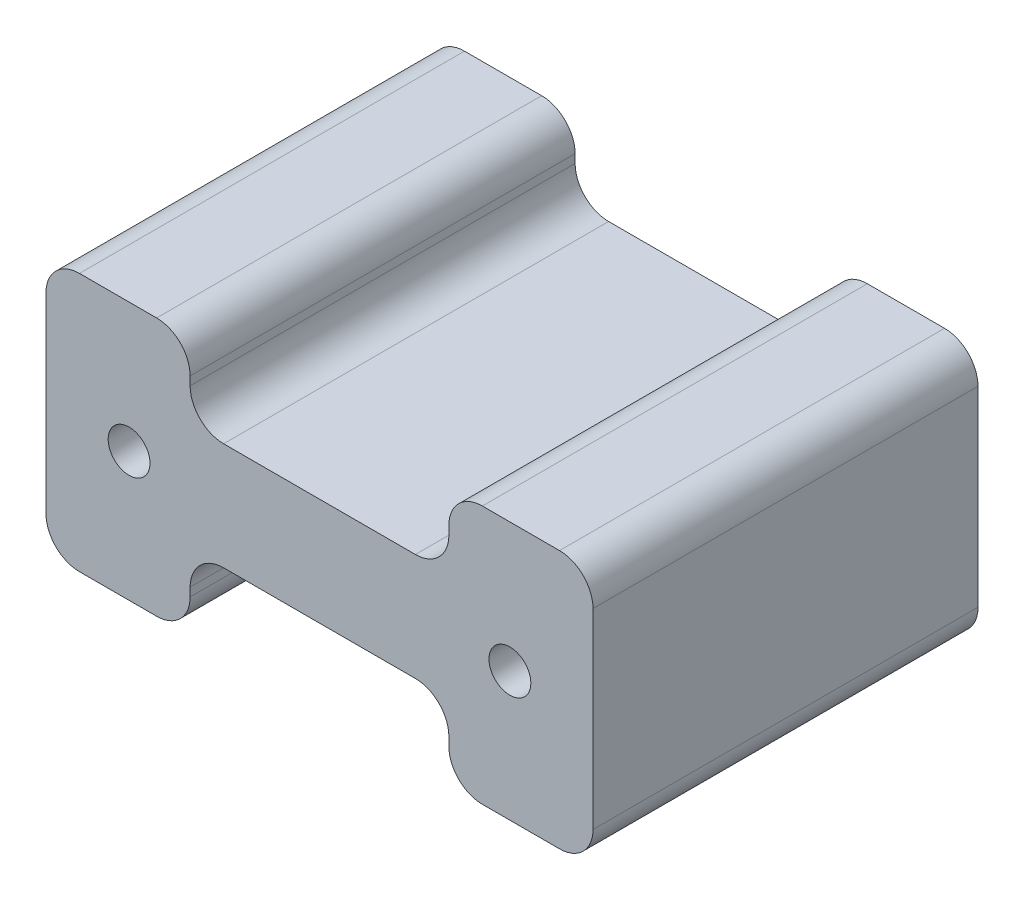
ISO-10303-21;
HEADER;
FILE_DESCRIPTION(('STEP AP214'),'2;1');
FILE_NAME('part.step','',(''),(''),'','','');
FILE_SCHEMA(('AUTOMOTIVE_DESIGN { 1 0 10303 214 1 1 1 1 }'));
ENDSEC;
DATA;
#1=APPLICATION_CONTEXT('core data for automotive mechanical design processes');
#2=APPLICATION_PROTOCOL_DEFINITION('international standard','automotive_design',2000,#1);
#3=PRODUCT_CONTEXT('',#1,'mechanical');
#4=PRODUCT('Part','Part','',(#3));
#5=PRODUCT_RELATED_PRODUCT_CATEGORY('part','',(#4));
#6=PRODUCT_DEFINITION_FORMATION('','',#4);
#7=PRODUCT_DEFINITION_CONTEXT('part definition',#1,'design');
#8=PRODUCT_DEFINITION('design','',#6,#7);
#9=PRODUCT_DEFINITION_SHAPE('','',#8);
#10=(LENGTH_UNIT() NAMED_UNIT(*) SI_UNIT(.MILLI.,.METRE.));
#11=(NAMED_UNIT(*) PLANE_ANGLE_UNIT() SI_UNIT($,.RADIAN.));
#12=(NAMED_UNIT(*) SI_UNIT($,.STERADIAN.) SOLID_ANGLE_UNIT());
#13=UNCERTAINTY_MEASURE_WITH_UNIT(LENGTH_MEASURE(1.E-05),#10,'distance_accuracy_value','');
#14=(GEOMETRIC_REPRESENTATION_CONTEXT(3) GLOBAL_UNCERTAINTY_ASSIGNED_CONTEXT((#13)) GLOBAL_UNIT_ASSIGNED_CONTEXT((#10,
#11,#12)) REPRESENTATION_CONTEXT('',''));
#15=CARTESIAN_POINT('',(0.,0.,0.));
#16=DIRECTION('',(0.,0.,1.));
#17=DIRECTION('',(1.,0.,0.));
#18=AXIS2_PLACEMENT_3D('',#15,#16,#17);
#19=CARTESIAN_POINT('',(-20.0653915042754,18.6420857532212,-23.));
#20=DIRECTION('',(0.,-1.,0.));
#21=DIRECTION('',(0.,0.,-1.));
#22=AXIS2_PLACEMENT_3D('',#19,#20,#21);
#23=PLANE('',#22);
#24=DIRECTION('',(1.,0.,0.));
#25=VECTOR('',#24,1.);
#26=CARTESIAN_POINT('',(-20.0653915042754,18.6420857532212,0.));
#27=LINE('',#26,#25);
#28=CARTESIAN_POINT('',(6.00236147383035,18.6420857532212,0.));
#29=VERTEX_POINT('',#28);
#30=CARTESIAN_POINT('',(10.6119967977161,18.6420857532212,0.));
#31=VERTEX_POINT('',#30);
#32=EDGE_CURVE('E388',#29,#31,#27,.T.);
#33=ORIENTED_EDGE('',*,*,#32,.F.);
#34=DIRECTION('',(0.,0.,1.));
#35=VECTOR('',#34,1.);
#36=CARTESIAN_POINT('',(6.00236147383035,18.6420857532212,-23.));
#37=LINE('',#36,#35);
#38=CARTESIAN_POINT('',(6.00236147383035,18.6420857532212,-23.));
#39=VERTEX_POINT('',#38);
#40=EDGE_CURVE('E200',#29,#39,#37,.F.);
#41=ORIENTED_EDGE('',*,*,#40,.T.);
#42=DIRECTION('',(1.,0.,0.));
#43=VECTOR('',#42,1.);
#44=CARTESIAN_POINT('',(-20.0653915042754,18.6420857532212,-23.));
#45=LINE('',#44,#43);
#46=CARTESIAN_POINT('',(10.6119967977161,18.6420857532212,-23.));
#47=VERTEX_POINT('',#46);
#48=EDGE_CURVE('E194',#39,#47,#45,.T.);
#49=ORIENTED_EDGE('',*,*,#48,.T.);
#50=DIRECTION('',(0.,0.,1.));
#51=VECTOR('',#50,1.);
#52=CARTESIAN_POINT('',(10.6119967977161,18.6420857532212,-23.));
#53=LINE('',#52,#51);
#54=EDGE_CURVE('E198',#47,#31,#53,.T.);
#55=ORIENTED_EDGE('',*,*,#54,.T.);
#56=EDGE_LOOP('',(#33,#41,#49,#55));
#57=FACE_BOUND('',#56,.T.);
#58=ADVANCED_FACE('F33',(#57),#23,.T.);
#59=CARTESIAN_POINT('',(-20.0653915042754,34.0750636250568,-23.));
#60=DIRECTION('',(0.,1.,0.));
#61=DIRECTION('',(0.,0.,1.));
#62=AXIS2_PLACEMENT_3D('',#59,#60,#61);
#63=PLANE('',#62);
#64=DIRECTION('',(-1.,0.,0.));
#65=VECTOR('',#64,1.);
#66=CARTESIAN_POINT('',(-20.0653915042754,34.0750636250568,0.));
#67=LINE('',#66,#65);
#68=CARTESIAN_POINT('',(-13.4557561803896,34.0750636250568,0.));
#69=VERTEX_POINT('',#68);
#70=CARTESIAN_POINT('',(-18.0653915042754,34.0750636250568,0.));
#71=VERTEX_POINT('',#70);
#72=EDGE_CURVE('E380',#69,#71,#67,.T.);
#73=ORIENTED_EDGE('',*,*,#72,.F.);
#74=DIRECTION('',(0.,0.,1.));
#75=VECTOR('',#74,1.);
#76=CARTESIAN_POINT('',(-13.4557561803896,34.0750636250568,-23.));
#77=LINE('',#76,#75);
#78=CARTESIAN_POINT('',(-13.4557561803896,34.0750636250568,-23.));
#79=VERTEX_POINT('',#78);
#80=EDGE_CURVE('E269',#69,#79,#77,.F.);
#81=ORIENTED_EDGE('',*,*,#80,.T.);
#82=DIRECTION('',(-1.,0.,0.));
#83=VECTOR('',#82,1.);
#84=CARTESIAN_POINT('',(-20.0653915042754,34.0750636250568,-23.));
#85=LINE('',#84,#83);
#86=CARTESIAN_POINT('',(-18.0653915042754,34.0750636250568,-23.));
#87=VERTEX_POINT('',#86);
#88=EDGE_CURVE('E370',#79,#87,#85,.T.);
#89=ORIENTED_EDGE('',*,*,#88,.T.);
#90=DIRECTION('',(0.,0.,1.));
#91=VECTOR('',#90,1.);
#92=CARTESIAN_POINT('',(-18.0653915042754,34.0750636250568,-23.));
#93=LINE('',#92,#91);
#94=EDGE_CURVE('E253',#87,#71,#93,.T.);
#95=ORIENTED_EDGE('',*,*,#94,.T.);
#96=EDGE_LOOP('',(#73,#81,#89,#95));
#97=FACE_BOUND('',#96,.T.);
#98=ADVANCED_FACE('F444',(#97),#63,.T.);
#99=CARTESIAN_POINT('',(12.6119967977161,34.0750636250568,-23.));
#100=DIRECTION('',(1.,0.,0.));
#101=DIRECTION('',(0.,0.,-1.));
#102=AXIS2_PLACEMENT_3D('',#99,#100,#101);
#103=PLANE('',#102);
#104=DIRECTION('',(0.,1.,0.));
#105=VECTOR('',#104,1.);
#106=CARTESIAN_POINT('',(12.6119967977161,34.0750636250568,0.));
#107=LINE('',#106,#105);
#108=CARTESIAN_POINT('',(12.6119967977161,20.6420857532212,0.));
#109=VERTEX_POINT('',#108);
#110=CARTESIAN_POINT('',(12.6119967977161,32.0750636250568,0.));
#111=VERTEX_POINT('',#110);
#112=EDGE_CURVE('E377',#109,#111,#107,.T.);
#113=ORIENTED_EDGE('',*,*,#112,.F.);
#114=DIRECTION('',(0.,0.,1.));
#115=VECTOR('',#114,1.);
#116=CARTESIAN_POINT('',(12.6119967977161,20.6420857532212,-23.));
#117=LINE('',#116,#115);
#118=CARTESIAN_POINT('',(12.6119967977161,20.6420857532212,-23.));
#119=VERTEX_POINT('',#118);
#120=EDGE_CURVE('E237',#109,#119,#117,.F.);
#121=ORIENTED_EDGE('',*,*,#120,.T.);
#122=DIRECTION('',(0.,1.,0.));
#123=VECTOR('',#122,1.);
#124=CARTESIAN_POINT('',(12.6119967977161,34.0750636250568,-23.));
#125=LINE('',#124,#123);
#126=CARTESIAN_POINT('',(12.6119967977161,32.0750636250568,-23.));
#127=VERTEX_POINT('',#126);
#128=EDGE_CURVE('E211',#119,#127,#125,.T.);
#129=ORIENTED_EDGE('',*,*,#128,.T.);
#130=DIRECTION('',(0.,0.,1.));
#131=VECTOR('',#130,1.);
#132=CARTESIAN_POINT('',(12.6119967977161,32.0750636250568,-23.));
#133=LINE('',#132,#131);
#134=EDGE_CURVE('E234',#127,#111,#133,.T.);
#135=ORIENTED_EDGE('',*,*,#134,.T.);
#136=EDGE_LOOP('',(#113,#121,#129,#135));
#137=FACE_BOUND('',#136,.T.);
#138=ADVANCED_FACE('F446',(#137),#103,.T.);
#139=CARTESIAN_POINT('',(-18.0653915042754,18.6420857532212,-23.));
#140=VERTEX_POINT('',#139);
#141=CARTESIAN_POINT('',(-13.4557561803896,18.6420857532212,-23.));
#142=VERTEX_POINT('',#141);
#143=EDGE_CURVE('E202',#140,#142,#45,.T.);
#144=ORIENTED_EDGE('',*,*,#143,.T.);
#145=DIRECTION('',(0.,0.,-1.));
#146=VECTOR('',#145,1.);
#147=CARTESIAN_POINT('',(-13.4557561803896,18.6420857532212,0.));
#148=LINE('',#147,#146);
#149=CARTESIAN_POINT('',(-13.4557561803896,18.6420857532212,0.));
#150=VERTEX_POINT('',#149);
#151=EDGE_CURVE('E297',#142,#150,#148,.F.);
#152=ORIENTED_EDGE('',*,*,#151,.T.);
#153=CARTESIAN_POINT('',(-18.0653915042754,18.6420857532212,0.));
#154=VERTEX_POINT('',#153);
#155=EDGE_CURVE('E371',#154,#150,#27,.T.);
#156=ORIENTED_EDGE('',*,*,#155,.F.);
#157=DIRECTION('',(0.,0.,1.));
#158=VECTOR('',#157,1.);
#159=CARTESIAN_POINT('',(-18.0653915042754,18.6420857532212,-23.));
#160=LINE('',#159,#158);
#161=EDGE_CURVE('E251',#154,#140,#160,.F.);
#162=ORIENTED_EDGE('',*,*,#161,.T.);
#163=EDGE_LOOP('',(#144,#152,#156,#162));
#164=FACE_BOUND('',#163,.T.);
#165=ADVANCED_FACE('F422',(#164),#23,.T.);
#166=CARTESIAN_POINT('',(-20.0653915042754,34.0750636250568,-23.));
#167=DIRECTION('',(-1.,0.,0.));
#168=DIRECTION('',(0.,0.,1.));
#169=AXIS2_PLACEMENT_3D('',#166,#167,#168);
#170=PLANE('',#169);
#171=DIRECTION('',(0.,-1.,0.));
#172=VECTOR('',#171,1.);
#173=CARTESIAN_POINT('',(-20.0653915042754,34.0750636250568,-23.));
#174=LINE('',#173,#172);
#175=CARTESIAN_POINT('',(-20.0653915042754,32.0750636250568,-23.));
#176=VERTEX_POINT('',#175);
#177=CARTESIAN_POINT('',(-20.0653915042754,20.6420857532212,-23.));
#178=VERTEX_POINT('',#177);
#179=EDGE_CURVE('E203',#176,#178,#174,.T.);
#180=ORIENTED_EDGE('',*,*,#179,.T.);
#181=DIRECTION('',(0.,0.,1.));
#182=VECTOR('',#181,1.);
#183=CARTESIAN_POINT('',(-20.0653915042754,20.6420857532212,-23.));
#184=LINE('',#183,#182);
#185=CARTESIAN_POINT('',(-20.0653915042754,20.6420857532212,0.));
#186=VERTEX_POINT('',#185);
#187=EDGE_CURVE('E248',#178,#186,#184,.T.);
#188=ORIENTED_EDGE('',*,*,#187,.T.);
#189=DIRECTION('',(0.,-1.,0.));
#190=VECTOR('',#189,1.);
#191=CARTESIAN_POINT('',(-20.0653915042754,34.0750636250568,0.));
#192=LINE('',#191,#190);
#193=CARTESIAN_POINT('',(-20.0653915042754,32.0750636250568,0.));
#194=VERTEX_POINT('',#193);
#195=EDGE_CURVE('E385',#194,#186,#192,.T.);
#196=ORIENTED_EDGE('',*,*,#195,.F.);
#197=DIRECTION('',(0.,0.,1.));
#198=VECTOR('',#197,1.);
#199=CARTESIAN_POINT('',(-20.0653915042754,32.0750636250568,-23.));
#200=LINE('',#199,#198);
#201=EDGE_CURVE('E246',#194,#176,#200,.F.);
#202=ORIENTED_EDGE('',*,*,#201,.T.);
#203=EDGE_LOOP('',(#180,#188,#196,#202));
#204=FACE_BOUND('',#203,.T.);
#205=ADVANCED_FACE('F431',(#204),#170,.T.);
#206=CARTESIAN_POINT('',(10.6119967977161,34.0750636250568,-23.));
#207=VERTEX_POINT('',#206);
#208=CARTESIAN_POINT('',(6.00236147383036,34.0750636250568,-23.));
#209=VERTEX_POINT('',#208);
#210=EDGE_CURVE('E372',#207,#209,#85,.T.);
#211=ORIENTED_EDGE('',*,*,#210,.T.);
#212=DIRECTION('',(0.,0.,-1.));
#213=VECTOR('',#212,1.);
#214=CARTESIAN_POINT('',(6.00236147383035,34.0750636250568,0.));
#215=LINE('',#214,#213);
#216=CARTESIAN_POINT('',(6.00236147383036,34.0750636250568,0.));
#217=VERTEX_POINT('',#216);
#218=EDGE_CURVE('E283',#209,#217,#215,.F.);
#219=ORIENTED_EDGE('',*,*,#218,.T.);
#220=CARTESIAN_POINT('',(10.6119967977161,34.0750636250568,0.));
#221=VERTEX_POINT('',#220);
#222=EDGE_CURVE('E382',#221,#217,#67,.T.);
#223=ORIENTED_EDGE('',*,*,#222,.F.);
#224=DIRECTION('',(0.,0.,1.));
#225=VECTOR('',#224,1.);
#226=CARTESIAN_POINT('',(10.6119967977161,34.0750636250568,-23.));
#227=LINE('',#226,#225);
#228=EDGE_CURVE('E214',#221,#207,#227,.F.);
#229=ORIENTED_EDGE('',*,*,#228,.T.);
#230=EDGE_LOOP('',(#211,#219,#223,#229));
#231=FACE_BOUND('',#230,.T.);
#232=ADVANCED_FACE('F448',(#231),#63,.T.);
#233=CARTESIAN_POINT('',(0.,0.,-23.));
#234=DIRECTION('',(0.,0.,1.));
#235=DIRECTION('',(1.,0.,0.));
#236=AXIS2_PLACEMENT_3D('',#233,#234,#235);
#237=PLANE('',#236);
#238=CARTESIAN_POINT('',(-15.1016973532796,26.358574689139,-23.));
#239=DIRECTION('',(0.,0.,1.));
#240=DIRECTION('',(1.,0.,0.));
#241=AXIS2_PLACEMENT_3D('',#238,#239,#240);
#242=CIRCLE('',#241,1.25);
#243=CARTESIAN_POINT('',(-13.8516973532796,26.358574689139,-23.));
#244=VERTEX_POINT('',#243);
#245=EDGE_CURVE('E381',#244,#244,#242,.T.);
#246=ORIENTED_EDGE('',*,*,#245,.T.);
#247=EDGE_LOOP('',(#246));
#248=FACE_BOUND('',#247,.T.);
#249=CARTESIAN_POINT('',(7.64830264672036,26.358574689139,-23.));
#250=DIRECTION('',(0.,0.,1.));
#251=DIRECTION('',(1.,0.,0.));
#252=AXIS2_PLACEMENT_3D('',#249,#250,#251);
#253=CIRCLE('',#252,1.25);
#254=CARTESIAN_POINT('',(8.89830264672036,26.358574689139,-23.));
#255=VERTEX_POINT('',#254);
#256=EDGE_CURVE('E700',#255,#255,#253,.T.);
#257=ORIENTED_EDGE('',*,*,#256,.T.);
#258=EDGE_LOOP('',(#257));
#259=FACE_BOUND('',#258,.T.);
#260=ORIENTED_EDGE('',*,*,#88,.F.);
#261=CARTESIAN_POINT('',(-13.4557561803896,32.0750636250568,-23.));
#262=DIRECTION('',(0.,0.,1.));
#263=DIRECTION('',(1.,0.,0.));
#264=AXIS2_PLACEMENT_3D('',#261,#262,#263);
#265=CIRCLE('',#264,2.);
#266=CARTESIAN_POINT('',(-11.4557561803896,32.0750636250568,-23.));
#267=VERTEX_POINT('',#266);
#268=EDGE_CURVE('E276',#79,#267,#265,.F.);
#269=ORIENTED_EDGE('',*,*,#268,.T.);
#270=DIRECTION('',(0.,-1.,0.));
#271=VECTOR('',#270,1.);
#272=CARTESIAN_POINT('',(-11.4557561803896,29.5665320005796,-23.));
#273=LINE('',#272,#271);
#274=CARTESIAN_POINT('',(-11.4557561803896,31.5665320005796,-23.));
#275=VERTEX_POINT('',#274);
#276=EDGE_CURVE('E339',#267,#275,#273,.T.);
#277=ORIENTED_EDGE('',*,*,#276,.T.);
#278=CARTESIAN_POINT('',(-9.45575618038963,31.5665320005796,-23.));
#279=DIRECTION('',(0.,0.,1.));
#280=DIRECTION('',(1.,0.,0.));
#281=AXIS2_PLACEMENT_3D('',#278,#279,#280);
#282=CIRCLE('',#281,2.);
#283=CARTESIAN_POINT('',(-9.45575618038963,29.5665320005796,-23.));
#284=VERTEX_POINT('',#283);
#285=EDGE_CURVE('E11',#275,#284,#282,.T.);
#286=ORIENTED_EDGE('',*,*,#285,.T.);
#287=DIRECTION('',(1.,0.,0.));
#288=VECTOR('',#287,1.);
#289=CARTESIAN_POINT('',(4.00236147383035,29.5665320005796,-23.));
#290=LINE('',#289,#288);
#291=CARTESIAN_POINT('',(2.00236147383035,29.5665320005796,-23.));
#292=VERTEX_POINT('',#291);
#293=EDGE_CURVE('E337',#284,#292,#290,.T.);
#294=ORIENTED_EDGE('',*,*,#293,.T.);
#295=CARTESIAN_POINT('',(2.00236147383035,31.5665320005796,-23.));
#296=DIRECTION('',(0.,0.,1.));
#297=DIRECTION('',(1.,0.,0.));
#298=AXIS2_PLACEMENT_3D('',#295,#296,#297);
#299=CIRCLE('',#298,2.);
#300=CARTESIAN_POINT('',(4.00236147383035,31.5665320005796,-23.));
#301=VERTEX_POINT('',#300);
#302=EDGE_CURVE('E319',#292,#301,#299,.T.);
#303=ORIENTED_EDGE('',*,*,#302,.T.);
#304=DIRECTION('',(0.,1.,0.));
#305=VECTOR('',#304,1.);
#306=CARTESIAN_POINT('',(4.00236147383035,29.5665320005796,-23.));
#307=LINE('',#306,#305);
#308=CARTESIAN_POINT('',(4.00236147383035,32.0750636250568,-23.));
#309=VERTEX_POINT('',#308);
#310=EDGE_CURVE('E343',#301,#309,#307,.T.);
#311=ORIENTED_EDGE('',*,*,#310,.T.);
#312=CARTESIAN_POINT('',(6.00236147383035,32.0750636250568,-23.));
#313=DIRECTION('',(0.,0.,1.));
#314=DIRECTION('',(1.,0.,0.));
#315=AXIS2_PLACEMENT_3D('',#312,#313,#314);
#316=CIRCLE('',#315,2.);
#317=EDGE_CURVE('E48',#309,#209,#316,.F.);
#318=ORIENTED_EDGE('',*,*,#317,.T.);
#319=ORIENTED_EDGE('',*,*,#210,.F.);
#320=CARTESIAN_POINT('',(10.6119967977161,32.0750636250568,-23.));
#321=DIRECTION('',(0.,0.,1.));
#322=DIRECTION('',(1.,0.,0.));
#323=AXIS2_PLACEMENT_3D('',#320,#321,#322);
#324=CIRCLE('',#323,2.);
#325=EDGE_CURVE('E215',#207,#127,#324,.F.);
#326=ORIENTED_EDGE('',*,*,#325,.T.);
#327=ORIENTED_EDGE('',*,*,#128,.F.);
#328=CARTESIAN_POINT('',(10.6119967977161,20.6420857532212,-23.));
#329=DIRECTION('',(0.,0.,1.));
#330=DIRECTION('',(1.,0.,0.));
#331=AXIS2_PLACEMENT_3D('',#328,#329,#330);
#332=CIRCLE('',#331,2.);
#333=EDGE_CURVE('E207',#119,#47,#332,.F.);
#334=ORIENTED_EDGE('',*,*,#333,.T.);
#335=ORIENTED_EDGE('',*,*,#48,.F.);
#336=CARTESIAN_POINT('',(6.00236147383035,20.6420857532212,-23.));
#337=DIRECTION('',(0.,0.,1.));
#338=DIRECTION('',(1.,0.,0.));
#339=AXIS2_PLACEMENT_3D('',#336,#337,#338);
#340=CIRCLE('',#339,2.);
#341=CARTESIAN_POINT('',(4.00236147383035,20.6420857532212,-23.));
#342=VERTEX_POINT('',#341);
#343=EDGE_CURVE('E273',#39,#342,#340,.F.);
#344=ORIENTED_EDGE('',*,*,#343,.T.);
#345=DIRECTION('',(0.,1.,0.));
#346=VECTOR('',#345,1.);
#347=CARTESIAN_POINT('',(4.00236147383035,23.1506173776985,-23.));
#348=LINE('',#347,#346);
#349=CARTESIAN_POINT('',(4.00236147383035,21.1506173776985,-23.));
#350=VERTEX_POINT('',#349);
#351=EDGE_CURVE('E355',#342,#350,#348,.T.);
#352=ORIENTED_EDGE('',*,*,#351,.T.);
#353=CARTESIAN_POINT('',(2.00236147383035,21.1506173776985,-23.));
#354=DIRECTION('',(0.,0.,1.));
#355=DIRECTION('',(1.,0.,0.));
#356=AXIS2_PLACEMENT_3D('',#353,#354,#355);
#357=CIRCLE('',#356,2.);
#358=CARTESIAN_POINT('',(2.00236147383035,23.1506173776985,-23.));
#359=VERTEX_POINT('',#358);
#360=EDGE_CURVE('E315',#350,#359,#357,.T.);
#361=ORIENTED_EDGE('',*,*,#360,.T.);
#362=DIRECTION('',(-1.,0.,0.));
#363=VECTOR('',#362,1.);
#364=CARTESIAN_POINT('',(4.00236147383035,23.1506173776985,-23.));
#365=LINE('',#364,#363);
#366=CARTESIAN_POINT('',(-9.45575618038963,23.1506173776985,-23.));
#367=VERTEX_POINT('',#366);
#368=EDGE_CURVE('E358',#359,#367,#365,.T.);
#369=ORIENTED_EDGE('',*,*,#368,.T.);
#370=CARTESIAN_POINT('',(-9.45575618038964,21.1506173776985,-23.));
#371=DIRECTION('',(0.,0.,1.));
#372=DIRECTION('',(1.,0.,0.));
#373=AXIS2_PLACEMENT_3D('',#370,#371,#372);
#374=CIRCLE('',#373,2.);
#375=CARTESIAN_POINT('',(-11.4557561803896,21.1506173776985,-23.));
#376=VERTEX_POINT('',#375);
#377=EDGE_CURVE('E311',#367,#376,#374,.T.);
#378=ORIENTED_EDGE('',*,*,#377,.T.);
#379=DIRECTION('',(0.,-1.,0.));
#380=VECTOR('',#379,1.);
#381=CARTESIAN_POINT('',(-11.4557561803896,23.1506173776985,-23.));
#382=LINE('',#381,#380);
#383=CARTESIAN_POINT('',(-11.4557561803896,20.6420857532212,-23.));
#384=VERTEX_POINT('',#383);
#385=EDGE_CURVE('E352',#376,#384,#382,.T.);
#386=ORIENTED_EDGE('',*,*,#385,.T.);
#387=CARTESIAN_POINT('',(-13.4557561803896,20.6420857532212,-23.));
#388=DIRECTION('',(0.,0.,1.));
#389=DIRECTION('',(1.,0.,0.));
#390=AXIS2_PLACEMENT_3D('',#387,#388,#389);
#391=CIRCLE('',#390,2.);
#392=EDGE_CURVE('E271',#384,#142,#391,.F.);
#393=ORIENTED_EDGE('',*,*,#392,.T.);
#394=ORIENTED_EDGE('',*,*,#143,.F.);
#395=CARTESIAN_POINT('',(-18.0653915042754,20.6420857532212,-23.));
#396=DIRECTION('',(0.,0.,1.));
#397=DIRECTION('',(1.,0.,0.));
#398=AXIS2_PLACEMENT_3D('',#395,#396,#397);
#399=CIRCLE('',#398,2.);
#400=EDGE_CURVE('E242',#140,#178,#399,.F.);
#401=ORIENTED_EDGE('',*,*,#400,.T.);
#402=ORIENTED_EDGE('',*,*,#179,.F.);
#403=CARTESIAN_POINT('',(-18.0653915042754,32.0750636250568,-23.));
#404=DIRECTION('',(0.,0.,1.));
#405=DIRECTION('',(1.,0.,0.));
#406=AXIS2_PLACEMENT_3D('',#403,#404,#405);
#407=CIRCLE('',#406,2.);
#408=EDGE_CURVE('E239',#176,#87,#407,.F.);
#409=ORIENTED_EDGE('',*,*,#408,.T.);
#410=EDGE_LOOP('',(#260,#269,#277,#286,#294,#303,#311,#318,#319,#326,#327,#334,#335,#344,#352,
#361,#369,#378,#386,#393,#394,#401,#402,#409));
#411=FACE_BOUND('',#410,.T.);
#412=ADVANCED_FACE('F209',(#248,#259,#411),#237,.F.);
#413=CARTESIAN_POINT('',(0.,0.,0.));
#414=DIRECTION('',(0.,0.,1.));
#415=DIRECTION('',(1.,0.,0.));
#416=AXIS2_PLACEMENT_3D('',#413,#414,#415);
#417=PLANE('',#416);
#418=CARTESIAN_POINT('',(-15.1016973532796,26.358574689139,0.));
#419=DIRECTION('',(0.,0.,1.));
#420=DIRECTION('',(1.,0.,0.));
#421=AXIS2_PLACEMENT_3D('',#418,#419,#420);
#422=CIRCLE('',#421,1.25);
#423=CARTESIAN_POINT('',(-13.8516973532796,26.358574689139,0.));
#424=VERTEX_POINT('',#423);
#425=EDGE_CURVE('E696',#424,#424,#422,.T.);
#426=ORIENTED_EDGE('',*,*,#425,.F.);
#427=EDGE_LOOP('',(#426));
#428=FACE_BOUND('',#427,.T.);
#429=CARTESIAN_POINT('',(7.64830264672036,26.358574689139,0.));
#430=DIRECTION('',(0.,0.,1.));
#431=DIRECTION('',(1.,0.,0.));
#432=AXIS2_PLACEMENT_3D('',#429,#430,#431);
#433=CIRCLE('',#432,1.25);
#434=CARTESIAN_POINT('',(8.89830264672036,26.358574689139,0.));
#435=VERTEX_POINT('',#434);
#436=EDGE_CURVE('E345',#435,#435,#433,.T.);
#437=ORIENTED_EDGE('',*,*,#436,.F.);
#438=EDGE_LOOP('',(#437));
#439=FACE_BOUND('',#438,.T.);
#440=DIRECTION('',(0.,-1.,0.));
#441=VECTOR('',#440,1.);
#442=CARTESIAN_POINT('',(-11.4557561803896,0.,0.));
#443=LINE('',#442,#441);
#444=CARTESIAN_POINT('',(-11.4557561803896,32.0750636250568,0.));
#445=VERTEX_POINT('',#444);
#446=CARTESIAN_POINT('',(-11.4557561803896,31.5665320005796,0.));
#447=VERTEX_POINT('',#446);
#448=EDGE_CURVE('E221',#445,#447,#443,.T.);
#449=ORIENTED_EDGE('',*,*,#448,.F.);
#450=CARTESIAN_POINT('',(-13.4557561803896,32.0750636250568,0.));
#451=DIRECTION('',(0.,0.,1.));
#452=DIRECTION('',(1.,0.,0.));
#453=AXIS2_PLACEMENT_3D('',#450,#451,#452);
#454=CIRCLE('',#453,2.);
#455=EDGE_CURVE('E267',#445,#69,#454,.T.);
#456=ORIENTED_EDGE('',*,*,#455,.T.);
#457=ORIENTED_EDGE('',*,*,#72,.T.);
#458=CARTESIAN_POINT('',(-18.0653915042754,32.0750636250568,0.));
#459=DIRECTION('',(0.,0.,1.));
#460=DIRECTION('',(1.,0.,0.));
#461=AXIS2_PLACEMENT_3D('',#458,#459,#460);
#462=CIRCLE('',#461,2.);
#463=EDGE_CURVE('E220',#71,#194,#462,.T.);
#464=ORIENTED_EDGE('',*,*,#463,.T.);
#465=ORIENTED_EDGE('',*,*,#195,.T.);
#466=CARTESIAN_POINT('',(-18.0653915042754,20.6420857532212,0.));
#467=DIRECTION('',(0.,0.,1.));
#468=DIRECTION('',(1.,0.,0.));
#469=AXIS2_PLACEMENT_3D('',#466,#467,#468);
#470=CIRCLE('',#469,2.);
#471=EDGE_CURVE('E223',#186,#154,#470,.T.);
#472=ORIENTED_EDGE('',*,*,#471,.T.);
#473=ORIENTED_EDGE('',*,*,#155,.T.);
#474=CARTESIAN_POINT('',(-13.4557561803896,20.6420857532212,0.));
#475=DIRECTION('',(0.,0.,1.));
#476=DIRECTION('',(1.,0.,0.));
#477=AXIS2_PLACEMENT_3D('',#474,#475,#476);
#478=CIRCLE('',#477,2.);
#479=CARTESIAN_POINT('',(-11.4557561803896,20.6420857532212,0.));
#480=VERTEX_POINT('',#479);
#481=EDGE_CURVE('E261',#150,#480,#478,.T.);
#482=ORIENTED_EDGE('',*,*,#481,.T.);
#483=DIRECTION('',(0.,-1.,0.));
#484=VECTOR('',#483,1.);
#485=CARTESIAN_POINT('',(-11.4557561803896,23.1506173776985,0.));
#486=LINE('',#485,#484);
#487=CARTESIAN_POINT('',(-11.4557561803896,21.1506173776985,0.));
#488=VERTEX_POINT('',#487);
#489=EDGE_CURVE('E359',#488,#480,#486,.T.);
#490=ORIENTED_EDGE('',*,*,#489,.F.);
#491=CARTESIAN_POINT('',(-9.45575618038964,21.1506173776985,0.));
#492=DIRECTION('',(0.,0.,1.));
#493=DIRECTION('',(1.,0.,0.));
#494=AXIS2_PLACEMENT_3D('',#491,#492,#493);
#495=CIRCLE('',#494,2.);
#496=CARTESIAN_POINT('',(-9.45575618038963,23.1506173776985,0.));
#497=VERTEX_POINT('',#496);
#498=EDGE_CURVE('E309',#488,#497,#495,.F.);
#499=ORIENTED_EDGE('',*,*,#498,.T.);
#500=DIRECTION('',(-1.,0.,0.));
#501=VECTOR('',#500,1.);
#502=CARTESIAN_POINT('',(4.00236147383035,23.1506173776985,0.));
#503=LINE('',#502,#501);
#504=CARTESIAN_POINT('',(2.00236147383035,23.1506173776985,0.));
#505=VERTEX_POINT('',#504);
#506=EDGE_CURVE('E364',#505,#497,#503,.T.);
#507=ORIENTED_EDGE('',*,*,#506,.F.);
#508=CARTESIAN_POINT('',(2.00236147383035,21.1506173776985,0.));
#509=DIRECTION('',(0.,0.,1.));
#510=DIRECTION('',(1.,0.,0.));
#511=AXIS2_PLACEMENT_3D('',#508,#509,#510);
#512=CIRCLE('',#511,2.);
#513=CARTESIAN_POINT('',(4.00236147383035,21.1506173776985,0.));
#514=VERTEX_POINT('',#513);
#515=EDGE_CURVE('E313',#505,#514,#512,.F.);
#516=ORIENTED_EDGE('',*,*,#515,.T.);
#517=DIRECTION('',(0.,1.,0.));
#518=VECTOR('',#517,1.);
#519=CARTESIAN_POINT('',(4.00236147383032,0.,0.));
#520=LINE('',#519,#518);
#521=CARTESIAN_POINT('',(4.00236147383035,20.6420857532212,0.));
#522=VERTEX_POINT('',#521);
#523=EDGE_CURVE('E226',#522,#514,#520,.T.);
#524=ORIENTED_EDGE('',*,*,#523,.F.);
#525=CARTESIAN_POINT('',(6.00236147383035,20.6420857532212,0.));
#526=DIRECTION('',(0.,0.,1.));
#527=DIRECTION('',(1.,0.,0.));
#528=AXIS2_PLACEMENT_3D('',#525,#526,#527);
#529=CIRCLE('',#528,2.);
#530=EDGE_CURVE('E263',#522,#29,#529,.T.);
#531=ORIENTED_EDGE('',*,*,#530,.T.);
#532=ORIENTED_EDGE('',*,*,#32,.T.);
#533=CARTESIAN_POINT('',(10.6119967977161,20.6420857532212,0.));
#534=DIRECTION('',(0.,0.,1.));
#535=DIRECTION('',(1.,0.,0.));
#536=AXIS2_PLACEMENT_3D('',#533,#534,#535);
#537=CIRCLE('',#536,2.);
#538=EDGE_CURVE('E219',#31,#109,#537,.T.);
#539=ORIENTED_EDGE('',*,*,#538,.T.);
#540=ORIENTED_EDGE('',*,*,#112,.T.);
#541=CARTESIAN_POINT('',(10.6119967977161,32.0750636250568,0.));
#542=DIRECTION('',(0.,0.,1.));
#543=DIRECTION('',(1.,0.,0.));
#544=AXIS2_PLACEMENT_3D('',#541,#542,#543);
#545=CIRCLE('',#544,2.);
#546=EDGE_CURVE('E231',#111,#221,#545,.T.);
#547=ORIENTED_EDGE('',*,*,#546,.T.);
#548=ORIENTED_EDGE('',*,*,#222,.T.);
#549=CARTESIAN_POINT('',(6.00236147383035,32.0750636250568,0.));
#550=DIRECTION('',(0.,0.,1.));
#551=DIRECTION('',(1.,0.,0.));
#552=AXIS2_PLACEMENT_3D('',#549,#550,#551);
#553=CIRCLE('',#552,2.);
#554=CARTESIAN_POINT('',(4.00236147383035,32.0750636250568,0.));
#555=VERTEX_POINT('',#554);
#556=EDGE_CURVE('E265',#217,#555,#553,.T.);
#557=ORIENTED_EDGE('',*,*,#556,.T.);
#558=DIRECTION('',(0.,1.,0.));
#559=VECTOR('',#558,1.);
#560=CARTESIAN_POINT('',(4.00236147383035,29.5665320005796,0.));
#561=LINE('',#560,#559);
#562=CARTESIAN_POINT('',(4.00236147383035,31.5665320005796,0.));
#563=VERTEX_POINT('',#562);
#564=EDGE_CURVE('E347',#563,#555,#561,.T.);
#565=ORIENTED_EDGE('',*,*,#564,.F.);
#566=CARTESIAN_POINT('',(2.00236147383035,31.5665320005796,0.));
#567=DIRECTION('',(0.,0.,1.));
#568=DIRECTION('',(1.,0.,0.));
#569=AXIS2_PLACEMENT_3D('',#566,#567,#568);
#570=CIRCLE('',#569,2.);
#571=CARTESIAN_POINT('',(2.00236147383035,29.5665320005796,0.));
#572=VERTEX_POINT('',#571);
#573=EDGE_CURVE('E317',#563,#572,#570,.F.);
#574=ORIENTED_EDGE('',*,*,#573,.T.);
#575=DIRECTION('',(1.,0.,0.));
#576=VECTOR('',#575,1.);
#577=CARTESIAN_POINT('',(4.00236147383035,29.5665320005796,0.));
#578=LINE('',#577,#576);
#579=CARTESIAN_POINT('',(-9.45575618038963,29.5665320005796,0.));
#580=VERTEX_POINT('',#579);
#581=EDGE_CURVE('E325',#580,#572,#578,.T.);
#582=ORIENTED_EDGE('',*,*,#581,.F.);
#583=CARTESIAN_POINT('',(-9.45575618038963,31.5665320005796,0.));
#584=DIRECTION('',(0.,0.,1.));
#585=DIRECTION('',(1.,0.,0.));
#586=AXIS2_PLACEMENT_3D('',#583,#584,#585);
#587=CIRCLE('',#586,2.);
#588=EDGE_CURVE('E41',#580,#447,#587,.F.);
#589=ORIENTED_EDGE('',*,*,#588,.T.);
#590=EDGE_LOOP('',(#449,#456,#457,#464,#465,#472,#473,#482,#490,#499,#507,#516,#524,#531,#532,
#539,#540,#547,#548,#557,#565,#574,#582,#589));
#591=FACE_BOUND('',#590,.T.);
#592=ADVANCED_FACE('F323',(#428,#439,#591),#417,.T.);
#593=CARTESIAN_POINT('',(4.00236147383035,23.1506173776985,-23.));
#594=DIRECTION('',(1.,0.,0.));
#595=DIRECTION('',(0.,1.,0.));
#596=AXIS2_PLACEMENT_3D('',#593,#594,#595);
#597=PLANE('',#596);
#598=ORIENTED_EDGE('',*,*,#351,.F.);
#599=DIRECTION('',(0.,0.,1.));
#600=VECTOR('',#599,1.);
#601=CARTESIAN_POINT('',(4.00236147383035,20.6420857532212,0.));
#602=LINE('',#601,#600);
#603=EDGE_CURVE('E287',#342,#522,#602,.T.);
#604=ORIENTED_EDGE('',*,*,#603,.T.);
#605=ORIENTED_EDGE('',*,*,#523,.T.);
#606=DIRECTION('',(0.,0.,1.));
#607=VECTOR('',#606,1.);
#608=CARTESIAN_POINT('',(4.00236147383035,21.1506173776985,-23.));
#609=LINE('',#608,#607);
#610=EDGE_CURVE('E285',#514,#350,#609,.F.);
#611=ORIENTED_EDGE('',*,*,#610,.T.);
#612=EDGE_LOOP('',(#598,#604,#605,#611));
#613=FACE_BOUND('',#612,.T.);
#614=ADVANCED_FACE('F395',(#613),#597,.F.);
#615=CARTESIAN_POINT('',(-11.4557561803896,23.1506173776985,-23.));
#616=DIRECTION('',(-1.,0.,0.));
#617=DIRECTION('',(0.,-1.,0.));
#618=AXIS2_PLACEMENT_3D('',#615,#616,#617);
#619=PLANE('',#618);
#620=ORIENTED_EDGE('',*,*,#489,.T.);
#621=DIRECTION('',(0.,0.,-1.));
#622=VECTOR('',#621,1.);
#623=CARTESIAN_POINT('',(-11.4557561803896,20.6420857532212,-23.));
#624=LINE('',#623,#622);
#625=EDGE_CURVE('E294',#480,#384,#624,.T.);
#626=ORIENTED_EDGE('',*,*,#625,.T.);
#627=ORIENTED_EDGE('',*,*,#385,.F.);
#628=DIRECTION('',(0.,0.,1.));
#629=VECTOR('',#628,1.);
#630=CARTESIAN_POINT('',(-11.4557561803896,21.1506173776985,0.));
#631=LINE('',#630,#629);
#632=EDGE_CURVE('E291',#376,#488,#631,.T.);
#633=ORIENTED_EDGE('',*,*,#632,.T.);
#634=EDGE_LOOP('',(#620,#626,#627,#633));
#635=FACE_BOUND('',#634,.T.);
#636=ADVANCED_FACE('F412',(#635),#619,.F.);
#637=CARTESIAN_POINT('',(4.00236147383035,23.1506173776985,-23.));
#638=DIRECTION('',(0.,1.,0.));
#639=DIRECTION('',(-1.,0.,0.));
#640=AXIS2_PLACEMENT_3D('',#637,#638,#639);
#641=PLANE('',#640);
#642=ORIENTED_EDGE('',*,*,#506,.T.);
#643=DIRECTION('',(0.,0.,1.));
#644=VECTOR('',#643,1.);
#645=CARTESIAN_POINT('',(-9.45575618038963,23.1506173776985,-23.));
#646=LINE('',#645,#644);
#647=EDGE_CURVE('E302',#497,#367,#646,.F.);
#648=ORIENTED_EDGE('',*,*,#647,.T.);
#649=ORIENTED_EDGE('',*,*,#368,.F.);
#650=DIRECTION('',(0.,0.,1.));
#651=VECTOR('',#650,1.);
#652=CARTESIAN_POINT('',(2.00236147383035,23.1506173776985,0.));
#653=LINE('',#652,#651);
#654=EDGE_CURVE('E299',#359,#505,#653,.T.);
#655=ORIENTED_EDGE('',*,*,#654,.T.);
#656=EDGE_LOOP('',(#642,#648,#649,#655));
#657=FACE_BOUND('',#656,.T.);
#658=ADVANCED_FACE('F404',(#657),#641,.F.);
#659=CARTESIAN_POINT('',(-11.4557561803896,29.5665320005796,-23.));
#660=DIRECTION('',(-1.,0.,0.));
#661=DIRECTION('',(0.,0.,1.));
#662=AXIS2_PLACEMENT_3D('',#659,#660,#661);
#663=PLANE('',#662);
#664=ORIENTED_EDGE('',*,*,#276,.F.);
#665=DIRECTION('',(0.,0.,1.));
#666=VECTOR('',#665,1.);
#667=CARTESIAN_POINT('',(-11.4557561803896,32.0750636250568,0.));
#668=LINE('',#667,#666);
#669=EDGE_CURVE('E258',#267,#445,#668,.T.);
#670=ORIENTED_EDGE('',*,*,#669,.T.);
#671=ORIENTED_EDGE('',*,*,#448,.T.);
#672=DIRECTION('',(0.,0.,1.));
#673=VECTOR('',#672,1.);
#674=CARTESIAN_POINT('',(-11.4557561803896,31.5665320005796,-23.));
#675=LINE('',#674,#673);
#676=EDGE_CURVE('E256',#447,#275,#675,.F.);
#677=ORIENTED_EDGE('',*,*,#676,.T.);
#678=EDGE_LOOP('',(#664,#670,#671,#677));
#679=FACE_BOUND('',#678,.T.);
#680=ADVANCED_FACE('F331',(#679),#663,.F.);
#681=CARTESIAN_POINT('',(4.00236147383035,29.5665320005796,-23.));
#682=DIRECTION('',(1.,0.,0.));
#683=DIRECTION('',(0.,0.,-1.));
#684=AXIS2_PLACEMENT_3D('',#681,#682,#683);
#685=PLANE('',#684);
#686=ORIENTED_EDGE('',*,*,#564,.T.);
#687=DIRECTION('',(0.,0.,-1.));
#688=VECTOR('',#687,1.);
#689=CARTESIAN_POINT('',(4.00236147383035,32.0750636250568,-23.));
#690=LINE('',#689,#688);
#691=EDGE_CURVE('E281',#555,#309,#690,.T.);
#692=ORIENTED_EDGE('',*,*,#691,.T.);
#693=ORIENTED_EDGE('',*,*,#310,.F.);
#694=DIRECTION('',(0.,0.,1.));
#695=VECTOR('',#694,1.);
#696=CARTESIAN_POINT('',(4.00236147383035,31.5665320005796,0.));
#697=LINE('',#696,#695);
#698=EDGE_CURVE('E278',#301,#563,#697,.T.);
#699=ORIENTED_EDGE('',*,*,#698,.T.);
#700=EDGE_LOOP('',(#686,#692,#693,#699));
#701=FACE_BOUND('',#700,.T.);
#702=ADVANCED_FACE('F472',(#701),#685,.F.);
#703=CARTESIAN_POINT('',(4.00236147383035,29.5665320005796,-23.));
#704=DIRECTION('',(0.,-1.,0.));
#705=DIRECTION('',(0.,0.,-1.));
#706=AXIS2_PLACEMENT_3D('',#703,#704,#705);
#707=PLANE('',#706);
#708=ORIENTED_EDGE('',*,*,#581,.T.);
#709=DIRECTION('',(0.,0.,1.));
#710=VECTOR('',#709,1.);
#711=CARTESIAN_POINT('',(2.00236147383035,29.5665320005796,-23.));
#712=LINE('',#711,#710);
#713=EDGE_CURVE('E307',#572,#292,#712,.F.);
#714=ORIENTED_EDGE('',*,*,#713,.T.);
#715=ORIENTED_EDGE('',*,*,#293,.F.);
#716=DIRECTION('',(0.,0.,1.));
#717=VECTOR('',#716,1.);
#718=CARTESIAN_POINT('',(-9.45575618038963,29.5665320005796,0.));
#719=LINE('',#718,#717);
#720=EDGE_CURVE('E304',#284,#580,#719,.T.);
#721=ORIENTED_EDGE('',*,*,#720,.T.);
#722=EDGE_LOOP('',(#708,#714,#715,#721));
#723=FACE_BOUND('',#722,.T.);
#724=ADVANCED_FACE('F341',(#723),#707,.F.);
#725=CARTESIAN_POINT('',(7.64830264672036,26.358574689139,-23.));
#726=DIRECTION('',(0.,0.,1.));
#727=DIRECTION('',(1.,0.,0.));
#728=AXIS2_PLACEMENT_3D('',#725,#726,#727);
#729=CYLINDRICAL_SURFACE('',#728,1.25);
#730=ORIENTED_EDGE('',*,*,#256,.F.);
#731=EDGE_LOOP('',(#730));
#732=FACE_BOUND('',#731,.T.);
#733=ORIENTED_EDGE('',*,*,#436,.T.);
#734=EDGE_LOOP('',(#733));
#735=FACE_BOUND('',#734,.T.);
#736=ADVANCED_FACE('F509',(#732,#735),#729,.F.);
#737=CARTESIAN_POINT('',(-15.1016973532796,26.358574689139,-23.));
#738=DIRECTION('',(0.,0.,1.));
#739=DIRECTION('',(1.,0.,0.));
#740=AXIS2_PLACEMENT_3D('',#737,#738,#739);
#741=CYLINDRICAL_SURFACE('',#740,1.25);
#742=ORIENTED_EDGE('',*,*,#245,.F.);
#743=EDGE_LOOP('',(#742));
#744=FACE_BOUND('',#743,.T.);
#745=ORIENTED_EDGE('',*,*,#425,.T.);
#746=EDGE_LOOP('',(#745));
#747=FACE_BOUND('',#746,.T.);
#748=ADVANCED_FACE('F505',(#744,#747),#741,.F.);
#749=CARTESIAN_POINT('',(10.6119967977161,20.6420857532212,-23.));
#750=DIRECTION('',(0.,0.,1.));
#751=DIRECTION('',(1.,0.,0.));
#752=AXIS2_PLACEMENT_3D('',#749,#750,#751);
#753=CYLINDRICAL_SURFACE('',#752,2.);
#754=ORIENTED_EDGE('',*,*,#333,.F.);
#755=ORIENTED_EDGE('',*,*,#120,.F.);
#756=ORIENTED_EDGE('',*,*,#538,.F.);
#757=ORIENTED_EDGE('',*,*,#54,.F.);
#758=EDGE_LOOP('',(#754,#755,#756,#757));
#759=FACE_BOUND('',#758,.T.);
#760=ADVANCED_FACE('F218',(#759),#753,.T.);
#761=CARTESIAN_POINT('',(10.6119967977161,32.0750636250568,-23.));
#762=DIRECTION('',(0.,0.,1.));
#763=DIRECTION('',(1.,0.,0.));
#764=AXIS2_PLACEMENT_3D('',#761,#762,#763);
#765=CYLINDRICAL_SURFACE('',#764,2.);
#766=ORIENTED_EDGE('',*,*,#325,.F.);
#767=ORIENTED_EDGE('',*,*,#228,.F.);
#768=ORIENTED_EDGE('',*,*,#546,.F.);
#769=ORIENTED_EDGE('',*,*,#134,.F.);
#770=EDGE_LOOP('',(#766,#767,#768,#769));
#771=FACE_BOUND('',#770,.T.);
#772=ADVANCED_FACE('F500',(#771),#765,.T.);
#773=CARTESIAN_POINT('',(-18.0653915042754,20.6420857532212,-23.));
#774=DIRECTION('',(0.,0.,1.));
#775=DIRECTION('',(1.,0.,0.));
#776=AXIS2_PLACEMENT_3D('',#773,#774,#775);
#777=CYLINDRICAL_SURFACE('',#776,2.);
#778=ORIENTED_EDGE('',*,*,#400,.F.);
#779=ORIENTED_EDGE('',*,*,#161,.F.);
#780=ORIENTED_EDGE('',*,*,#471,.F.);
#781=ORIENTED_EDGE('',*,*,#187,.F.);
#782=EDGE_LOOP('',(#778,#779,#780,#781));
#783=FACE_BOUND('',#782,.T.);
#784=ADVANCED_FACE('F426',(#783),#777,.T.);
#785=CARTESIAN_POINT('',(-18.0653915042754,32.0750636250568,-23.));
#786=DIRECTION('',(0.,0.,1.));
#787=DIRECTION('',(1.,0.,0.));
#788=AXIS2_PLACEMENT_3D('',#785,#786,#787);
#789=CYLINDRICAL_SURFACE('',#788,2.);
#790=ORIENTED_EDGE('',*,*,#408,.F.);
#791=ORIENTED_EDGE('',*,*,#201,.F.);
#792=ORIENTED_EDGE('',*,*,#463,.F.);
#793=ORIENTED_EDGE('',*,*,#94,.F.);
#794=EDGE_LOOP('',(#790,#791,#792,#793));
#795=FACE_BOUND('',#794,.T.);
#796=ADVANCED_FACE('F436',(#795),#789,.T.);
#797=CARTESIAN_POINT('',(-13.4557561803896,32.0750636250568,-23.));
#798=DIRECTION('',(0.,0.,-1.));
#799=DIRECTION('',(-1.,0.,0.));
#800=AXIS2_PLACEMENT_3D('',#797,#798,#799);
#801=CYLINDRICAL_SURFACE('',#800,2.);
#802=ORIENTED_EDGE('',*,*,#268,.F.);
#803=ORIENTED_EDGE('',*,*,#80,.F.);
#804=ORIENTED_EDGE('',*,*,#455,.F.);
#805=ORIENTED_EDGE('',*,*,#669,.F.);
#806=EDGE_LOOP('',(#802,#803,#804,#805));
#807=FACE_BOUND('',#806,.T.);
#808=ADVANCED_FACE('F442',(#807),#801,.T.);
#809=CARTESIAN_POINT('',(6.00236147383035,32.0750636250568,-23.));
#810=DIRECTION('',(0.,0.,1.));
#811=DIRECTION('',(1.,0.,0.));
#812=AXIS2_PLACEMENT_3D('',#809,#810,#811);
#813=CYLINDRICAL_SURFACE('',#812,2.);
#814=ORIENTED_EDGE('',*,*,#556,.F.);
#815=ORIENTED_EDGE('',*,*,#218,.F.);
#816=ORIENTED_EDGE('',*,*,#317,.F.);
#817=ORIENTED_EDGE('',*,*,#691,.F.);
#818=EDGE_LOOP('',(#814,#815,#816,#817));
#819=FACE_BOUND('',#818,.T.);
#820=ADVANCED_FACE('F469',(#819),#813,.T.);
#821=CARTESIAN_POINT('',(6.00236147383035,20.6420857532212,-23.));
#822=DIRECTION('',(0.,0.,-1.));
#823=DIRECTION('',(-1.,0.,0.));
#824=AXIS2_PLACEMENT_3D('',#821,#822,#823);
#825=CYLINDRICAL_SURFACE('',#824,2.);
#826=ORIENTED_EDGE('',*,*,#343,.F.);
#827=ORIENTED_EDGE('',*,*,#40,.F.);
#828=ORIENTED_EDGE('',*,*,#530,.F.);
#829=ORIENTED_EDGE('',*,*,#603,.F.);
#830=EDGE_LOOP('',(#826,#827,#828,#829));
#831=FACE_BOUND('',#830,.T.);
#832=ADVANCED_FACE('F488',(#831),#825,.T.);
#833=CARTESIAN_POINT('',(-13.4557561803896,20.6420857532212,-23.));
#834=DIRECTION('',(0.,0.,1.));
#835=DIRECTION('',(1.,0.,0.));
#836=AXIS2_PLACEMENT_3D('',#833,#834,#835);
#837=CYLINDRICAL_SURFACE('',#836,2.);
#838=ORIENTED_EDGE('',*,*,#481,.F.);
#839=ORIENTED_EDGE('',*,*,#151,.F.);
#840=ORIENTED_EDGE('',*,*,#392,.F.);
#841=ORIENTED_EDGE('',*,*,#625,.F.);
#842=EDGE_LOOP('',(#838,#839,#840,#841));
#843=FACE_BOUND('',#842,.T.);
#844=ADVANCED_FACE('F417',(#843),#837,.T.);
#845=CARTESIAN_POINT('',(-9.45575618038964,21.1506173776985,-23.));
#846=DIRECTION('',(0.,0.,-1.));
#847=DIRECTION('',(-1.,0.,0.));
#848=AXIS2_PLACEMENT_3D('',#845,#846,#847);
#849=CYLINDRICAL_SURFACE('',#848,2.);
#850=ORIENTED_EDGE('',*,*,#377,.F.);
#851=ORIENTED_EDGE('',*,*,#647,.F.);
#852=ORIENTED_EDGE('',*,*,#498,.F.);
#853=ORIENTED_EDGE('',*,*,#632,.F.);
#854=EDGE_LOOP('',(#850,#851,#852,#853));
#855=FACE_BOUND('',#854,.T.);
#856=ADVANCED_FACE('F408',(#855),#849,.F.);
#857=CARTESIAN_POINT('',(2.00236147383035,21.1506173776985,-23.));
#858=DIRECTION('',(0.,0.,-1.));
#859=DIRECTION('',(-1.,0.,0.));
#860=AXIS2_PLACEMENT_3D('',#857,#858,#859);
#861=CYLINDRICAL_SURFACE('',#860,2.);
#862=ORIENTED_EDGE('',*,*,#360,.F.);
#863=ORIENTED_EDGE('',*,*,#610,.F.);
#864=ORIENTED_EDGE('',*,*,#515,.F.);
#865=ORIENTED_EDGE('',*,*,#654,.F.);
#866=EDGE_LOOP('',(#862,#863,#864,#865));
#867=FACE_BOUND('',#866,.T.);
#868=ADVANCED_FACE('F399',(#867),#861,.F.);
#869=CARTESIAN_POINT('',(2.00236147383035,31.5665320005796,-23.));
#870=DIRECTION('',(0.,0.,-1.));
#871=DIRECTION('',(-1.,0.,0.));
#872=AXIS2_PLACEMENT_3D('',#869,#870,#871);
#873=CYLINDRICAL_SURFACE('',#872,2.);
#874=ORIENTED_EDGE('',*,*,#302,.F.);
#875=ORIENTED_EDGE('',*,*,#713,.F.);
#876=ORIENTED_EDGE('',*,*,#573,.F.);
#877=ORIENTED_EDGE('',*,*,#698,.F.);
#878=EDGE_LOOP('',(#874,#875,#876,#877));
#879=FACE_BOUND('',#878,.T.);
#880=ADVANCED_FACE('F476',(#879),#873,.F.);
#881=CARTESIAN_POINT('',(-9.45575618038963,31.5665320005796,-23.));
#882=DIRECTION('',(0.,0.,-1.));
#883=DIRECTION('',(-1.,0.,0.));
#884=AXIS2_PLACEMENT_3D('',#881,#882,#883);
#885=CYLINDRICAL_SURFACE('',#884,2.);
#886=ORIENTED_EDGE('',*,*,#285,.F.);
#887=ORIENTED_EDGE('',*,*,#676,.F.);
#888=ORIENTED_EDGE('',*,*,#588,.F.);
#889=ORIENTED_EDGE('',*,*,#720,.F.);
#890=EDGE_LOOP('',(#886,#887,#888,#889));
#891=FACE_BOUND('',#890,.T.);
#892=ADVANCED_FACE('F35',(#891),#885,.F.);
#893=CLOSED_SHELL('',(#58,#98,#138,#165,#205,#232,#412,#592,#614,#636,#658,#680,#702,#724,#736,
#748,#760,#772,#784,#796,#808,#820,#832,#844,#856,#868,#880,#892));
#894=MANIFOLD_SOLID_BREP('B2',#893);
#895=ADVANCED_BREP_SHAPE_REPRESENTATION('',(#18,#894),#14);
#896=SHAPE_DEFINITION_REPRESENTATION(#9,#895);
ENDSEC;
END-ISO-10303-21;
